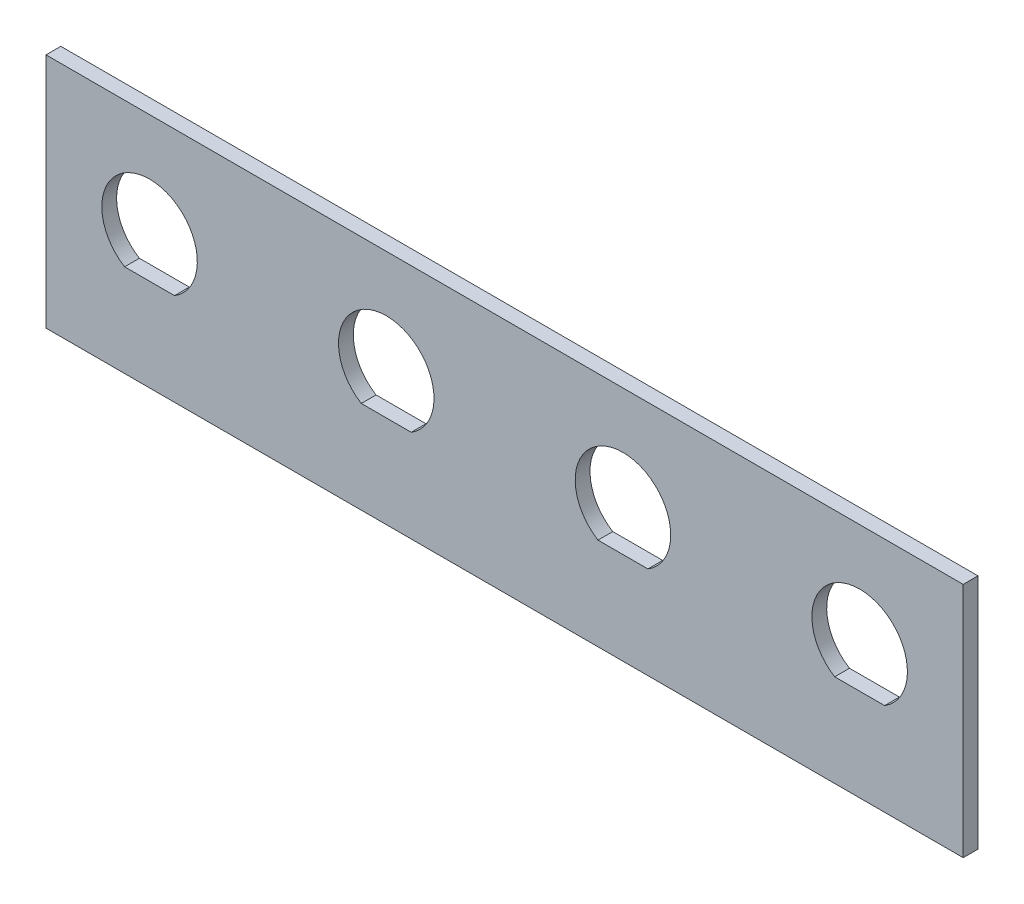
ISO-10303-21;
HEADER;
FILE_DESCRIPTION(('STEP AP214'),'2;1');
FILE_NAME('part.step','',(''),(''),'','','');
FILE_SCHEMA(('AUTOMOTIVE_DESIGN { 1 0 10303 214 1 1 1 1 }'));
ENDSEC;
DATA;
#1=APPLICATION_CONTEXT('core data for automotive mechanical design processes');
#2=APPLICATION_PROTOCOL_DEFINITION('international standard','automotive_design',2000,#1);
#3=PRODUCT_CONTEXT('',#1,'mechanical');
#4=PRODUCT('Part','Part','',(#3));
#5=PRODUCT_RELATED_PRODUCT_CATEGORY('part','',(#4));
#6=PRODUCT_DEFINITION_FORMATION('','',#4);
#7=PRODUCT_DEFINITION_CONTEXT('part definition',#1,'design');
#8=PRODUCT_DEFINITION('design','',#6,#7);
#9=PRODUCT_DEFINITION_SHAPE('','',#8);
#10=(LENGTH_UNIT() NAMED_UNIT(*) SI_UNIT(.MILLI.,.METRE.));
#11=(NAMED_UNIT(*) PLANE_ANGLE_UNIT() SI_UNIT($,.RADIAN.));
#12=(NAMED_UNIT(*) SI_UNIT($,.STERADIAN.) SOLID_ANGLE_UNIT());
#13=UNCERTAINTY_MEASURE_WITH_UNIT(LENGTH_MEASURE(1.E-05),#10,'distance_accuracy_value','');
#14=(GEOMETRIC_REPRESENTATION_CONTEXT(3) GLOBAL_UNCERTAINTY_ASSIGNED_CONTEXT((#13)) GLOBAL_UNIT_ASSIGNED_CONTEXT((#10,
#11,#12)) REPRESENTATION_CONTEXT('',''));
#15=CARTESIAN_POINT('',(0.,0.,0.));
#16=DIRECTION('',(0.,0.,1.));
#17=DIRECTION('',(1.,0.,0.));
#18=AXIS2_PLACEMENT_3D('',#15,#16,#17);
#19=CARTESIAN_POINT('',(101.6,50.8,63.5));
#20=DIRECTION('',(0.,0.,-1.));
#21=DIRECTION('',(-1.,0.,0.));
#22=AXIS2_PLACEMENT_3D('',#19,#20,#21);
#23=PLANE('',#22);
#24=CARTESIAN_POINT('',(76.2,28.575,63.5));
#25=DIRECTION('',(0.,0.,1.));
#26=DIRECTION('',(1.,0.,0.));
#27=AXIS2_PLACEMENT_3D('',#24,#25,#26);
#28=CIRCLE('',#27,10.2489);
#29=CARTESIAN_POINT('',(81.5567058394129,19.8374,63.5));
#30=VERTEX_POINT('',#29);
#31=CARTESIAN_POINT('',(70.8432941605871,19.8374,63.5));
#32=VERTEX_POINT('',#31);
#33=EDGE_CURVE('E183',#30,#32,#28,.T.);
#34=ORIENTED_EDGE('',*,*,#33,.F.);
#35=DIRECTION('',(1.,0.,0.));
#36=VECTOR('',#35,1.);
#37=CARTESIAN_POINT('',(0.,19.8374,63.5));
#38=LINE('',#37,#36);
#39=EDGE_CURVE('E51',#32,#30,#38,.T.);
#40=ORIENTED_EDGE('',*,*,#39,.F.);
#41=EDGE_LOOP('',(#34,#40));
#42=FACE_BOUND('',#41,.T.);
#43=CARTESIAN_POINT('',(25.4,28.575,63.5));
#44=DIRECTION('',(0.,0.,1.));
#45=DIRECTION('',(1.,0.,0.));
#46=AXIS2_PLACEMENT_3D('',#43,#44,#45);
#47=CIRCLE('',#46,10.2489);
#48=CARTESIAN_POINT('',(30.7567058394129,19.8374,63.5));
#49=VERTEX_POINT('',#48);
#50=CARTESIAN_POINT('',(20.0432941605871,19.8374,63.5));
#51=VERTEX_POINT('',#50);
#52=EDGE_CURVE('E190',#49,#51,#47,.T.);
#53=ORIENTED_EDGE('',*,*,#52,.F.);
#54=DIRECTION('',(1.,0.,0.));
#55=VECTOR('',#54,1.);
#56=CARTESIAN_POINT('',(0.,19.8374,63.5));
#57=LINE('',#56,#55);
#58=EDGE_CURVE('E185',#51,#49,#57,.T.);
#59=ORIENTED_EDGE('',*,*,#58,.F.);
#60=EDGE_LOOP('',(#53,#59));
#61=FACE_BOUND('',#60,.T.);
#62=CARTESIAN_POINT('',(-25.4,28.575,63.5));
#63=DIRECTION('',(0.,0.,1.));
#64=DIRECTION('',(1.,0.,0.));
#65=AXIS2_PLACEMENT_3D('',#62,#63,#64);
#66=CIRCLE('',#65,10.2489);
#67=CARTESIAN_POINT('',(-20.0432941605871,19.8374,63.5));
#68=VERTEX_POINT('',#67);
#69=CARTESIAN_POINT('',(-30.7567058394129,19.8374,63.5));
#70=VERTEX_POINT('',#69);
#71=EDGE_CURVE('E200',#68,#70,#66,.T.);
#72=ORIENTED_EDGE('',*,*,#71,.F.);
#73=DIRECTION('',(1.,0.,0.));
#74=VECTOR('',#73,1.);
#75=CARTESIAN_POINT('',(0.,19.8374,63.5));
#76=LINE('',#75,#74);
#77=EDGE_CURVE('E196',#70,#68,#76,.T.);
#78=ORIENTED_EDGE('',*,*,#77,.F.);
#79=EDGE_LOOP('',(#72,#78));
#80=FACE_BOUND('',#79,.T.);
#81=CARTESIAN_POINT('',(-76.2,28.575,63.5));
#82=DIRECTION('',(0.,0.,1.));
#83=DIRECTION('',(1.,0.,0.));
#84=AXIS2_PLACEMENT_3D('',#81,#82,#83);
#85=CIRCLE('',#84,10.2489);
#86=CARTESIAN_POINT('',(-70.8432941605871,19.8374,63.5));
#87=VERTEX_POINT('',#86);
#88=CARTESIAN_POINT('',(-81.5567058394129,19.8374,63.5));
#89=VERTEX_POINT('',#88);
#90=EDGE_CURVE('E210',#87,#89,#85,.T.);
#91=ORIENTED_EDGE('',*,*,#90,.F.);
#92=DIRECTION('',(1.,0.,0.));
#93=VECTOR('',#92,1.);
#94=CARTESIAN_POINT('',(0.,19.8374,63.5));
#95=LINE('',#94,#93);
#96=EDGE_CURVE('E206',#89,#87,#95,.T.);
#97=ORIENTED_EDGE('',*,*,#96,.F.);
#98=EDGE_LOOP('',(#91,#97));
#99=FACE_BOUND('',#98,.T.);
#100=DIRECTION('',(1.,0.,0.));
#101=VECTOR('',#100,1.);
#102=CARTESIAN_POINT('',(101.6,50.8,63.5));
#103=LINE('',#102,#101);
#104=CARTESIAN_POINT('',(-98.425,50.8,63.5));
#105=VERTEX_POINT('',#104);
#106=CARTESIAN_POINT('',(98.425,50.8,63.5));
#107=VERTEX_POINT('',#106);
#108=EDGE_CURVE('E150',#105,#107,#103,.T.);
#109=ORIENTED_EDGE('',*,*,#108,.F.);
#110=DIRECTION('',(0.,1.,0.));
#111=VECTOR('',#110,1.);
#112=CARTESIAN_POINT('',(-98.425,0.,63.5));
#113=LINE('',#112,#111);
#114=CARTESIAN_POINT('',(-98.425,0.,63.5));
#115=VERTEX_POINT('',#114);
#116=EDGE_CURVE('E136',#115,#105,#113,.T.);
#117=ORIENTED_EDGE('',*,*,#116,.F.);
#118=DIRECTION('',(1.,0.,0.));
#119=VECTOR('',#118,1.);
#120=CARTESIAN_POINT('',(101.6,0.,63.5));
#121=LINE('',#120,#119);
#122=CARTESIAN_POINT('',(98.425,0.,63.5));
#123=VERTEX_POINT('',#122);
#124=EDGE_CURVE('E144',#115,#123,#121,.T.);
#125=ORIENTED_EDGE('',*,*,#124,.T.);
#126=DIRECTION('',(0.,1.,0.));
#127=VECTOR('',#126,1.);
#128=CARTESIAN_POINT('',(98.425,0.,63.5));
#129=LINE('',#128,#127);
#130=EDGE_CURVE('E125',#123,#107,#129,.T.);
#131=ORIENTED_EDGE('',*,*,#130,.T.);
#132=EDGE_LOOP('',(#109,#117,#125,#131));
#133=FACE_BOUND('',#132,.T.);
#134=ADVANCED_FACE('F37',(#42,#61,#80,#99,#133),#23,.F.);
#135=CARTESIAN_POINT('',(0.,50.8,0.));
#136=DIRECTION('',(0.,1.,0.));
#137=DIRECTION('',(0.,0.,1.));
#138=AXIS2_PLACEMENT_3D('',#135,#136,#137);
#139=PLANE('',#138);
#140=DIRECTION('',(0.,0.,-1.));
#141=VECTOR('',#140,1.);
#142=CARTESIAN_POINT('',(-98.425,50.8,60.325));
#143=LINE('',#142,#141);
#144=CARTESIAN_POINT('',(-98.425,50.8,60.325));
#145=VERTEX_POINT('',#144);
#146=EDGE_CURVE('E147',#105,#145,#143,.T.);
#147=ORIENTED_EDGE('',*,*,#146,.F.);
#148=ORIENTED_EDGE('',*,*,#108,.T.);
#149=DIRECTION('',(0.,0.,1.));
#150=VECTOR('',#149,1.);
#151=CARTESIAN_POINT('',(98.425,50.8,60.325));
#152=LINE('',#151,#150);
#153=CARTESIAN_POINT('',(98.425,50.8,60.325));
#154=VERTEX_POINT('',#153);
#155=EDGE_CURVE('E131',#154,#107,#152,.T.);
#156=ORIENTED_EDGE('',*,*,#155,.F.);
#157=DIRECTION('',(1.,0.,0.));
#158=VECTOR('',#157,1.);
#159=CARTESIAN_POINT('',(-98.425,50.8,60.325));
#160=LINE('',#159,#158);
#161=EDGE_CURVE('E216',#145,#154,#160,.T.);
#162=ORIENTED_EDGE('',*,*,#161,.F.);
#163=EDGE_LOOP('',(#147,#148,#156,#162));
#164=FACE_BOUND('',#163,.T.);
#165=ADVANCED_FACE('F227',(#164),#139,.T.);
#166=CARTESIAN_POINT('',(0.,0.,0.));
#167=DIRECTION('',(0.,1.,0.));
#168=DIRECTION('',(0.,0.,1.));
#169=AXIS2_PLACEMENT_3D('',#166,#167,#168);
#170=PLANE('',#169);
#171=ORIENTED_EDGE('',*,*,#124,.F.);
#172=DIRECTION('',(0.,0.,-1.));
#173=VECTOR('',#172,1.);
#174=CARTESIAN_POINT('',(-98.425,0.,60.325));
#175=LINE('',#174,#173);
#176=CARTESIAN_POINT('',(-98.425,0.,60.325));
#177=VERTEX_POINT('',#176);
#178=EDGE_CURVE('E137',#115,#177,#175,.T.);
#179=ORIENTED_EDGE('',*,*,#178,.T.);
#180=DIRECTION('',(1.,0.,0.));
#181=VECTOR('',#180,1.);
#182=CARTESIAN_POINT('',(-98.425,0.,60.325));
#183=LINE('',#182,#181);
#184=CARTESIAN_POINT('',(98.425,0.,60.325));
#185=VERTEX_POINT('',#184);
#186=EDGE_CURVE('E146',#177,#185,#183,.T.);
#187=ORIENTED_EDGE('',*,*,#186,.T.);
#188=DIRECTION('',(0.,0.,1.));
#189=VECTOR('',#188,1.);
#190=CARTESIAN_POINT('',(98.425,0.,60.325));
#191=LINE('',#190,#189);
#192=EDGE_CURVE('E128',#185,#123,#191,.T.);
#193=ORIENTED_EDGE('',*,*,#192,.T.);
#194=EDGE_LOOP('',(#171,#179,#187,#193));
#195=FACE_BOUND('',#194,.T.);
#196=ADVANCED_FACE('F142',(#195),#170,.F.);
#197=CARTESIAN_POINT('',(-98.425,0.,60.325));
#198=DIRECTION('',(0.,0.,1.));
#199=DIRECTION('',(1.,0.,0.));
#200=AXIS2_PLACEMENT_3D('',#197,#198,#199);
#201=PLANE('',#200);
#202=CARTESIAN_POINT('',(76.2,28.575,60.325));
#203=DIRECTION('',(0.,0.,1.));
#204=DIRECTION('',(1.,0.,0.));
#205=AXIS2_PLACEMENT_3D('',#202,#203,#204);
#206=CIRCLE('',#205,10.2489);
#207=CARTESIAN_POINT('',(81.5567058394129,19.8374,60.325));
#208=VERTEX_POINT('',#207);
#209=CARTESIAN_POINT('',(70.8432941605871,19.8374,60.325));
#210=VERTEX_POINT('',#209);
#211=EDGE_CURVE('E44',#208,#210,#206,.T.);
#212=ORIENTED_EDGE('',*,*,#211,.T.);
#213=DIRECTION('',(1.,0.,0.));
#214=VECTOR('',#213,1.);
#215=CARTESIAN_POINT('',(-98.425,19.8374,60.325));
#216=LINE('',#215,#214);
#217=EDGE_CURVE('E11',#210,#208,#216,.T.);
#218=ORIENTED_EDGE('',*,*,#217,.T.);
#219=EDGE_LOOP('',(#212,#218));
#220=FACE_BOUND('',#219,.T.);
#221=CARTESIAN_POINT('',(25.4,28.575,60.325));
#222=DIRECTION('',(0.,0.,1.));
#223=DIRECTION('',(1.,0.,0.));
#224=AXIS2_PLACEMENT_3D('',#221,#222,#223);
#225=CIRCLE('',#224,10.2489);
#226=CARTESIAN_POINT('',(30.7567058394129,19.8374,60.325));
#227=VERTEX_POINT('',#226);
#228=CARTESIAN_POINT('',(20.0432941605871,19.8374,60.325));
#229=VERTEX_POINT('',#228);
#230=EDGE_CURVE('E170',#227,#229,#225,.T.);
#231=ORIENTED_EDGE('',*,*,#230,.T.);
#232=DIRECTION('',(1.,0.,0.));
#233=VECTOR('',#232,1.);
#234=CARTESIAN_POINT('',(-98.425,19.8374,60.325));
#235=LINE('',#234,#233);
#236=EDGE_CURVE('E173',#229,#227,#235,.T.);
#237=ORIENTED_EDGE('',*,*,#236,.T.);
#238=EDGE_LOOP('',(#231,#237));
#239=FACE_BOUND('',#238,.T.);
#240=CARTESIAN_POINT('',(-25.4,28.575,60.325));
#241=DIRECTION('',(0.,0.,1.));
#242=DIRECTION('',(1.,0.,0.));
#243=AXIS2_PLACEMENT_3D('',#240,#241,#242);
#244=CIRCLE('',#243,10.2489);
#245=CARTESIAN_POINT('',(-20.0432941605871,19.8374,60.325));
#246=VERTEX_POINT('',#245);
#247=CARTESIAN_POINT('',(-30.7567058394129,19.8374,60.325));
#248=VERTEX_POINT('',#247);
#249=EDGE_CURVE('E164',#246,#248,#244,.T.);
#250=ORIENTED_EDGE('',*,*,#249,.T.);
#251=DIRECTION('',(1.,0.,0.));
#252=VECTOR('',#251,1.);
#253=CARTESIAN_POINT('',(-98.425,19.8374,60.325));
#254=LINE('',#253,#252);
#255=EDGE_CURVE('E167',#248,#246,#254,.T.);
#256=ORIENTED_EDGE('',*,*,#255,.T.);
#257=EDGE_LOOP('',(#250,#256));
#258=FACE_BOUND('',#257,.T.);
#259=CARTESIAN_POINT('',(-76.2,28.575,60.325));
#260=DIRECTION('',(0.,0.,1.));
#261=DIRECTION('',(1.,0.,0.));
#262=AXIS2_PLACEMENT_3D('',#259,#260,#261);
#263=CIRCLE('',#262,10.2489);
#264=CARTESIAN_POINT('',(-70.8432941605871,19.8374,60.325));
#265=VERTEX_POINT('',#264);
#266=CARTESIAN_POINT('',(-81.5567058394129,19.8374,60.325));
#267=VERTEX_POINT('',#266);
#268=EDGE_CURVE('E153',#265,#267,#263,.T.);
#269=ORIENTED_EDGE('',*,*,#268,.T.);
#270=DIRECTION('',(1.,0.,0.));
#271=VECTOR('',#270,1.);
#272=CARTESIAN_POINT('',(-98.425,19.8374,60.325));
#273=LINE('',#272,#271);
#274=EDGE_CURVE('E161',#267,#265,#273,.T.);
#275=ORIENTED_EDGE('',*,*,#274,.T.);
#276=EDGE_LOOP('',(#269,#275));
#277=FACE_BOUND('',#276,.T.);
#278=ORIENTED_EDGE('',*,*,#161,.T.);
#279=DIRECTION('',(0.,1.,0.));
#280=VECTOR('',#279,1.);
#281=CARTESIAN_POINT('',(98.425,0.,60.325));
#282=LINE('',#281,#280);
#283=EDGE_CURVE('E151',#185,#154,#282,.T.);
#284=ORIENTED_EDGE('',*,*,#283,.F.);
#285=ORIENTED_EDGE('',*,*,#186,.F.);
#286=DIRECTION('',(0.,1.,0.));
#287=VECTOR('',#286,1.);
#288=CARTESIAN_POINT('',(-98.425,0.,60.325));
#289=LINE('',#288,#287);
#290=EDGE_CURVE('E155',#177,#145,#289,.T.);
#291=ORIENTED_EDGE('',*,*,#290,.T.);
#292=EDGE_LOOP('',(#278,#284,#285,#291));
#293=FACE_BOUND('',#292,.T.);
#294=ADVANCED_FACE('F177',(#220,#239,#258,#277,#293),#201,.F.);
#295=CARTESIAN_POINT('',(-76.2,28.575,-63.5));
#296=DIRECTION('',(0.,0.,1.));
#297=DIRECTION('',(1.,0.,0.));
#298=AXIS2_PLACEMENT_3D('',#295,#296,#297);
#299=CYLINDRICAL_SURFACE('',#298,10.2489);
#300=DIRECTION('',(0.,0.,1.));
#301=VECTOR('',#300,1.);
#302=CARTESIAN_POINT('',(-70.8432941605871,19.8374,-63.5));
#303=LINE('',#302,#301);
#304=EDGE_CURVE('E213',#265,#87,#303,.T.);
#305=ORIENTED_EDGE('',*,*,#304,.T.);
#306=ORIENTED_EDGE('',*,*,#90,.T.);
#307=DIRECTION('',(0.,0.,1.));
#308=VECTOR('',#307,1.);
#309=CARTESIAN_POINT('',(-81.5567058394129,19.8374,-63.5));
#310=LINE('',#309,#308);
#311=EDGE_CURVE('E214',#267,#89,#310,.T.);
#312=ORIENTED_EDGE('',*,*,#311,.F.);
#313=ORIENTED_EDGE('',*,*,#268,.F.);
#314=EDGE_LOOP('',(#305,#306,#312,#313));
#315=FACE_BOUND('',#314,.T.);
#316=ADVANCED_FACE('F258',(#315),#299,.F.);
#317=CARTESIAN_POINT('',(0.,19.8374,-63.5));
#318=DIRECTION('',(0.,-1.,0.));
#319=DIRECTION('',(1.,0.,0.));
#320=AXIS2_PLACEMENT_3D('',#317,#318,#319);
#321=PLANE('',#320);
#322=ORIENTED_EDGE('',*,*,#311,.T.);
#323=ORIENTED_EDGE('',*,*,#96,.T.);
#324=ORIENTED_EDGE('',*,*,#304,.F.);
#325=ORIENTED_EDGE('',*,*,#274,.F.);
#326=EDGE_LOOP('',(#322,#323,#324,#325));
#327=FACE_BOUND('',#326,.T.);
#328=ADVANCED_FACE('F262',(#327),#321,.F.);
#329=CARTESIAN_POINT('',(-25.4,28.575,-63.5));
#330=DIRECTION('',(0.,0.,1.));
#331=DIRECTION('',(1.,0.,0.));
#332=AXIS2_PLACEMENT_3D('',#329,#330,#331);
#333=CYLINDRICAL_SURFACE('',#332,10.2489);
#334=DIRECTION('',(0.,0.,1.));
#335=VECTOR('',#334,1.);
#336=CARTESIAN_POINT('',(-20.0432941605871,19.8374,-63.5));
#337=LINE('',#336,#335);
#338=EDGE_CURVE('E203',#246,#68,#337,.T.);
#339=ORIENTED_EDGE('',*,*,#338,.T.);
#340=ORIENTED_EDGE('',*,*,#71,.T.);
#341=DIRECTION('',(0.,0.,1.));
#342=VECTOR('',#341,1.);
#343=CARTESIAN_POINT('',(-30.7567058394129,19.8374,-63.5));
#344=LINE('',#343,#342);
#345=EDGE_CURVE('E204',#248,#70,#344,.T.);
#346=ORIENTED_EDGE('',*,*,#345,.F.);
#347=ORIENTED_EDGE('',*,*,#249,.F.);
#348=EDGE_LOOP('',(#339,#340,#346,#347));
#349=FACE_BOUND('',#348,.T.);
#350=ADVANCED_FACE('F273',(#349),#333,.F.);
#351=CARTESIAN_POINT('',(0.,19.8374,-63.5));
#352=DIRECTION('',(0.,-1.,0.));
#353=DIRECTION('',(1.,0.,0.));
#354=AXIS2_PLACEMENT_3D('',#351,#352,#353);
#355=PLANE('',#354);
#356=ORIENTED_EDGE('',*,*,#345,.T.);
#357=ORIENTED_EDGE('',*,*,#77,.T.);
#358=ORIENTED_EDGE('',*,*,#338,.F.);
#359=ORIENTED_EDGE('',*,*,#255,.F.);
#360=EDGE_LOOP('',(#356,#357,#358,#359));
#361=FACE_BOUND('',#360,.T.);
#362=ADVANCED_FACE('F275',(#361),#355,.F.);
#363=CARTESIAN_POINT('',(25.4,28.575,-63.5));
#364=DIRECTION('',(0.,0.,1.));
#365=DIRECTION('',(1.,0.,0.));
#366=AXIS2_PLACEMENT_3D('',#363,#364,#365);
#367=CYLINDRICAL_SURFACE('',#366,10.2489);
#368=DIRECTION('',(0.,0.,1.));
#369=VECTOR('',#368,1.);
#370=CARTESIAN_POINT('',(30.7567058394129,19.8374,-63.5));
#371=LINE('',#370,#369);
#372=EDGE_CURVE('E193',#227,#49,#371,.T.);
#373=ORIENTED_EDGE('',*,*,#372,.T.);
#374=ORIENTED_EDGE('',*,*,#52,.T.);
#375=DIRECTION('',(0.,0.,1.));
#376=VECTOR('',#375,1.);
#377=CARTESIAN_POINT('',(20.0432941605871,19.8374,-63.5));
#378=LINE('',#377,#376);
#379=EDGE_CURVE('E194',#229,#51,#378,.T.);
#380=ORIENTED_EDGE('',*,*,#379,.F.);
#381=ORIENTED_EDGE('',*,*,#230,.F.);
#382=EDGE_LOOP('',(#373,#374,#380,#381));
#383=FACE_BOUND('',#382,.T.);
#384=ADVANCED_FACE('F278',(#383),#367,.F.);
#385=CARTESIAN_POINT('',(0.,19.8374,-63.5));
#386=DIRECTION('',(0.,-1.,0.));
#387=DIRECTION('',(1.,0.,0.));
#388=AXIS2_PLACEMENT_3D('',#385,#386,#387);
#389=PLANE('',#388);
#390=ORIENTED_EDGE('',*,*,#379,.T.);
#391=ORIENTED_EDGE('',*,*,#58,.T.);
#392=ORIENTED_EDGE('',*,*,#372,.F.);
#393=ORIENTED_EDGE('',*,*,#236,.F.);
#394=EDGE_LOOP('',(#390,#391,#392,#393));
#395=FACE_BOUND('',#394,.T.);
#396=ADVANCED_FACE('F283',(#395),#389,.F.);
#397=CARTESIAN_POINT('',(76.2,28.575,-63.5));
#398=DIRECTION('',(0.,0.,1.));
#399=DIRECTION('',(1.,0.,0.));
#400=AXIS2_PLACEMENT_3D('',#397,#398,#399);
#401=CYLINDRICAL_SURFACE('',#400,10.2489);
#402=DIRECTION('',(0.,0.,1.));
#403=VECTOR('',#402,1.);
#404=CARTESIAN_POINT('',(81.5567058394129,19.8374,-63.5));
#405=LINE('',#404,#403);
#406=EDGE_CURVE('E180',#208,#30,#405,.T.);
#407=ORIENTED_EDGE('',*,*,#406,.T.);
#408=ORIENTED_EDGE('',*,*,#33,.T.);
#409=DIRECTION('',(0.,0.,1.));
#410=VECTOR('',#409,1.);
#411=CARTESIAN_POINT('',(70.8432941605871,19.8374,-63.5));
#412=LINE('',#411,#410);
#413=EDGE_CURVE('E58',#210,#32,#412,.T.);
#414=ORIENTED_EDGE('',*,*,#413,.F.);
#415=ORIENTED_EDGE('',*,*,#211,.F.);
#416=EDGE_LOOP('',(#407,#408,#414,#415));
#417=FACE_BOUND('',#416,.T.);
#418=ADVANCED_FACE('F179',(#417),#401,.F.);
#419=CARTESIAN_POINT('',(0.,19.8374,-63.5));
#420=DIRECTION('',(0.,-1.,0.));
#421=DIRECTION('',(1.,0.,0.));
#422=AXIS2_PLACEMENT_3D('',#419,#420,#421);
#423=PLANE('',#422);
#424=ORIENTED_EDGE('',*,*,#413,.T.);
#425=ORIENTED_EDGE('',*,*,#39,.T.);
#426=ORIENTED_EDGE('',*,*,#406,.F.);
#427=ORIENTED_EDGE('',*,*,#217,.F.);
#428=EDGE_LOOP('',(#424,#425,#426,#427));
#429=FACE_BOUND('',#428,.T.);
#430=ADVANCED_FACE('F182',(#429),#423,.F.);
#431=CARTESIAN_POINT('',(-98.425,0.,60.325));
#432=DIRECTION('',(1.,0.,0.));
#433=DIRECTION('',(0.,0.,-1.));
#434=AXIS2_PLACEMENT_3D('',#431,#432,#433);
#435=PLANE('',#434);
#436=ORIENTED_EDGE('',*,*,#146,.T.);
#437=ORIENTED_EDGE('',*,*,#290,.F.);
#438=ORIENTED_EDGE('',*,*,#178,.F.);
#439=ORIENTED_EDGE('',*,*,#116,.T.);
#440=EDGE_LOOP('',(#436,#437,#438,#439));
#441=FACE_BOUND('',#440,.T.);
#442=ADVANCED_FACE('F233',(#441),#435,.F.);
#443=CARTESIAN_POINT('',(98.425,0.,60.325));
#444=DIRECTION('',(-1.,0.,0.));
#445=DIRECTION('',(0.,0.,1.));
#446=AXIS2_PLACEMENT_3D('',#443,#444,#445);
#447=PLANE('',#446);
#448=ORIENTED_EDGE('',*,*,#155,.T.);
#449=ORIENTED_EDGE('',*,*,#130,.F.);
#450=ORIENTED_EDGE('',*,*,#192,.F.);
#451=ORIENTED_EDGE('',*,*,#283,.T.);
#452=EDGE_LOOP('',(#448,#449,#450,#451));
#453=FACE_BOUND('',#452,.T.);
#454=ADVANCED_FACE('F127',(#453),#447,.F.);
#455=CLOSED_SHELL('',(#134,#165,#196,#294,#316,#328,#350,#362,#384,#396,#418,#430,#442,#454));
#456=MANIFOLD_SOLID_BREP('B2',#455);
#457=ADVANCED_BREP_SHAPE_REPRESENTATION('',(#18,#456),#14);
#458=SHAPE_DEFINITION_REPRESENTATION(#9,#457);
ENDSEC;
END-ISO-10303-21;
